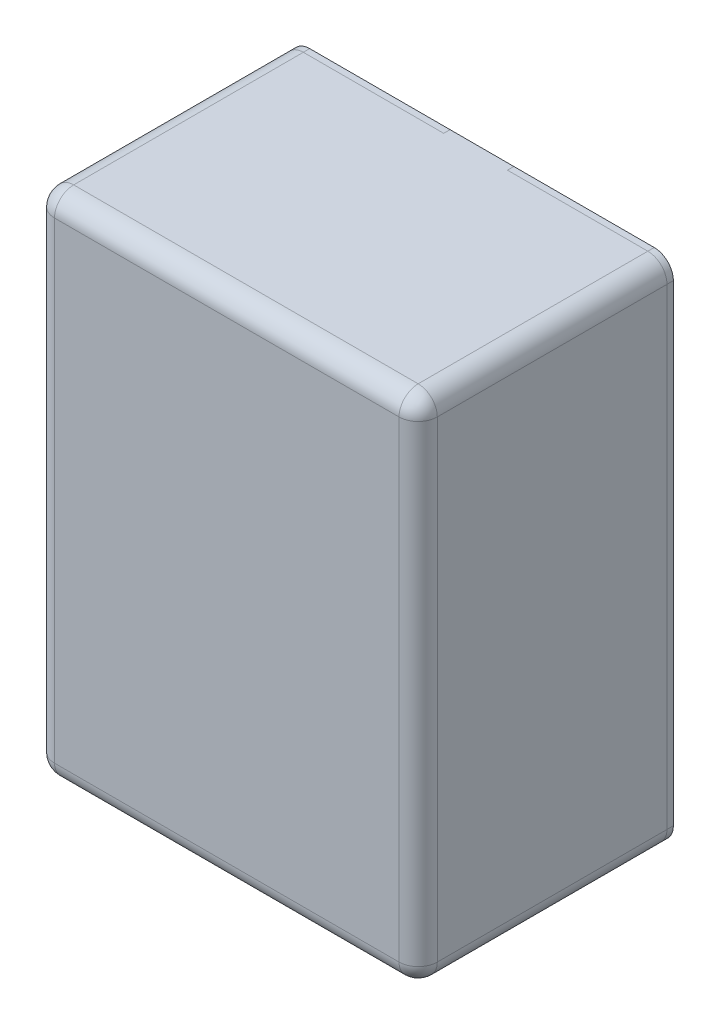
ISO-10303-21;
HEADER;
FILE_DESCRIPTION(('STEP AP214'),'2;1');
FILE_NAME('part.step','',(''),(''),'','','');
FILE_SCHEMA(('AUTOMOTIVE_DESIGN { 1 0 10303 214 1 1 1 1 }'));
ENDSEC;
DATA;
#1=APPLICATION_CONTEXT('core data for automotive mechanical design processes');
#2=APPLICATION_PROTOCOL_DEFINITION('international standard','automotive_design',2000,#1);
#3=PRODUCT_CONTEXT('',#1,'mechanical');
#4=PRODUCT('Part','Part','',(#3));
#5=PRODUCT_RELATED_PRODUCT_CATEGORY('part','',(#4));
#6=PRODUCT_DEFINITION_FORMATION('','',#4);
#7=PRODUCT_DEFINITION_CONTEXT('part definition',#1,'design');
#8=PRODUCT_DEFINITION('design','',#6,#7);
#9=PRODUCT_DEFINITION_SHAPE('','',#8);
#10=(LENGTH_UNIT() NAMED_UNIT(*) SI_UNIT(.MILLI.,.METRE.));
#11=(NAMED_UNIT(*) PLANE_ANGLE_UNIT() SI_UNIT($,.RADIAN.));
#12=(NAMED_UNIT(*) SI_UNIT($,.STERADIAN.) SOLID_ANGLE_UNIT());
#13=UNCERTAINTY_MEASURE_WITH_UNIT(LENGTH_MEASURE(1.E-05),#10,'distance_accuracy_value','');
#14=(GEOMETRIC_REPRESENTATION_CONTEXT(3) GLOBAL_UNCERTAINTY_ASSIGNED_CONTEXT((#13)) GLOBAL_UNIT_ASSIGNED_CONTEXT((#10,
#11,#12)) REPRESENTATION_CONTEXT('',''));
#15=CARTESIAN_POINT('',(0.,0.,0.));
#16=DIRECTION('',(0.,0.,1.));
#17=DIRECTION('',(1.,0.,0.));
#18=AXIS2_PLACEMENT_3D('',#15,#16,#17);
#19=CARTESIAN_POINT('',(-1.35,1.85,1.85));
#20=DIRECTION('',(0.,-1.,0.));
#21=DIRECTION('',(0.707106781186548,0.,-0.707106781186547));
#22=AXIS2_PLACEMENT_3D('',#19,#20,#21);
#23=CYLINDRICAL_SURFACE('',#22,0.15);
#24=CARTESIAN_POINT('',(-1.35,1.85,1.85));
#25=DIRECTION('',(0.,-1.,0.));
#26=DIRECTION('',(-1.,0.,0.));
#27=AXIS2_PLACEMENT_3D('',#24,#25,#26);
#28=CIRCLE('',#27,0.15);
#29=CARTESIAN_POINT('',(-1.35,1.85,2.));
#30=VERTEX_POINT('',#29);
#31=CARTESIAN_POINT('',(-1.5,1.85,1.85));
#32=VERTEX_POINT('',#31);
#33=EDGE_CURVE('E11',#30,#32,#28,.T.);
#34=ORIENTED_EDGE('',*,*,#33,.T.);
#35=DIRECTION('',(0.,-1.,0.));
#36=VECTOR('',#35,1.);
#37=CARTESIAN_POINT('',(-1.5,1.85,1.85));
#38=LINE('',#37,#36);
#39=CARTESIAN_POINT('',(-1.5,-1.85,1.85));
#40=VERTEX_POINT('',#39);
#41=EDGE_CURVE('E25',#32,#40,#38,.T.);
#42=ORIENTED_EDGE('',*,*,#41,.T.);
#43=CARTESIAN_POINT('',(-1.35,-1.85,1.85));
#44=DIRECTION('',(0.,-1.,0.));
#45=DIRECTION('',(-1.,0.,0.));
#46=AXIS2_PLACEMENT_3D('',#43,#44,#45);
#47=CIRCLE('',#46,0.15);
#48=CARTESIAN_POINT('',(-1.35,-1.85,2.));
#49=VERTEX_POINT('',#48);
#50=EDGE_CURVE('E431',#49,#40,#47,.T.);
#51=ORIENTED_EDGE('',*,*,#50,.F.);
#52=DIRECTION('',(0.,-1.,0.));
#53=VECTOR('',#52,1.);
#54=CARTESIAN_POINT('',(-1.35,1.85,2.));
#55=LINE('',#54,#53);
#56=EDGE_CURVE('E426',#30,#49,#55,.T.);
#57=ORIENTED_EDGE('',*,*,#56,.F.);
#58=EDGE_LOOP('',(#34,#42,#51,#57));
#59=FACE_BOUND('',#58,.T.);
#60=ADVANCED_FACE('F17',(#59),#23,.T.);
#61=CARTESIAN_POINT('',(-1.5,-2.,2.));
#62=DIRECTION('',(0.,0.,1.));
#63=DIRECTION('',(1.,0.,0.));
#64=AXIS2_PLACEMENT_3D('',#61,#62,#63);
#65=PLANE('',#64);
#66=DIRECTION('',(1.,0.,0.));
#67=VECTOR('',#66,1.);
#68=CARTESIAN_POINT('',(-1.35,-1.85,2.));
#69=LINE('',#68,#67);
#70=CARTESIAN_POINT('',(1.35,-1.85,2.));
#71=VERTEX_POINT('',#70);
#72=EDGE_CURVE('E422',#49,#71,#69,.T.);
#73=ORIENTED_EDGE('',*,*,#72,.T.);
#74=DIRECTION('',(0.,1.,0.));
#75=VECTOR('',#74,1.);
#76=CARTESIAN_POINT('',(1.35,-1.85,2.));
#77=LINE('',#76,#75);
#78=CARTESIAN_POINT('',(1.35,1.85,2.));
#79=VERTEX_POINT('',#78);
#80=EDGE_CURVE('E418',#71,#79,#77,.T.);
#81=ORIENTED_EDGE('',*,*,#80,.T.);
#82=DIRECTION('',(-1.,0.,0.));
#83=VECTOR('',#82,1.);
#84=CARTESIAN_POINT('',(1.35,1.85,2.));
#85=LINE('',#84,#83);
#86=EDGE_CURVE('E413',#79,#30,#85,.T.);
#87=ORIENTED_EDGE('',*,*,#86,.T.);
#88=ORIENTED_EDGE('',*,*,#56,.T.);
#89=EDGE_LOOP('',(#73,#81,#87,#88));
#90=FACE_BOUND('',#89,.T.);
#91=ADVANCED_FACE('F448',(#90),#65,.T.);
#92=CARTESIAN_POINT('',(1.35,1.85,1.85));
#93=DIRECTION('',(-1.,0.,0.));
#94=DIRECTION('',(0.,-0.707106781186548,-0.707106781186547));
#95=AXIS2_PLACEMENT_3D('',#92,#93,#94);
#96=CYLINDRICAL_SURFACE('',#95,0.15);
#97=CARTESIAN_POINT('',(1.35,1.85,1.85));
#98=DIRECTION('',(-1.,0.,0.));
#99=DIRECTION('',(0.,1.,0.));
#100=AXIS2_PLACEMENT_3D('',#97,#98,#99);
#101=CIRCLE('',#100,0.15);
#102=CARTESIAN_POINT('',(1.35,2.,1.85));
#103=VERTEX_POINT('',#102);
#104=EDGE_CURVE('E409',#79,#103,#101,.T.);
#105=ORIENTED_EDGE('',*,*,#104,.T.);
#106=DIRECTION('',(-1.,0.,0.));
#107=VECTOR('',#106,1.);
#108=CARTESIAN_POINT('',(1.35,2.,1.85));
#109=LINE('',#108,#107);
#110=CARTESIAN_POINT('',(-1.35,2.,1.85));
#111=VERTEX_POINT('',#110);
#112=EDGE_CURVE('E405',#103,#111,#109,.T.);
#113=ORIENTED_EDGE('',*,*,#112,.T.);
#114=CARTESIAN_POINT('',(-1.35,1.85,1.85));
#115=DIRECTION('',(-1.,0.,0.));
#116=DIRECTION('',(0.,0.,1.));
#117=AXIS2_PLACEMENT_3D('',#114,#115,#116);
#118=CIRCLE('',#117,0.15);
#119=EDGE_CURVE('E400',#30,#111,#118,.T.);
#120=ORIENTED_EDGE('',*,*,#119,.F.);
#121=ORIENTED_EDGE('',*,*,#86,.F.);
#122=EDGE_LOOP('',(#105,#113,#120,#121));
#123=FACE_BOUND('',#122,.T.);
#124=ADVANCED_FACE('F452',(#123),#96,.T.);
#125=CARTESIAN_POINT('',(-1.35,1.85,1.85));
#126=DIRECTION('',(-0.609395496705895,-0.492194586626505,-0.621596024351942));
#127=DIRECTION('',(0.788649817876852,-0.457034699362743,-0.411279404226879));
#128=AXIS2_PLACEMENT_3D('',#125,#126,#127);
#129=SPHERICAL_SURFACE('',#128,0.15);
#130=CARTESIAN_POINT('',(-1.35,1.85,1.85));
#131=DIRECTION('',(0.,0.,1.));
#132=DIRECTION('',(0.,1.,0.));
#133=AXIS2_PLACEMENT_3D('',#130,#131,#132);
#134=CIRCLE('',#133,0.15);
#135=EDGE_CURVE('E396',#111,#32,#134,.T.);
#136=ORIENTED_EDGE('',*,*,#135,.T.);
#137=ORIENTED_EDGE('',*,*,#33,.F.);
#138=ORIENTED_EDGE('',*,*,#119,.T.);
#139=EDGE_LOOP('',(#136,#137,#138));
#140=FACE_BOUND('',#139,.T.);
#141=ADVANCED_FACE('F455',(#140),#129,.T.);
#142=CARTESIAN_POINT('',(-1.35,1.85,0.));
#143=DIRECTION('',(0.,0.,1.));
#144=DIRECTION('',(0.707106781186547,-0.707106781186548,0.));
#145=AXIS2_PLACEMENT_3D('',#142,#143,#144);
#146=CYLINDRICAL_SURFACE('',#145,0.15);
#147=ORIENTED_EDGE('',*,*,#135,.F.);
#148=DIRECTION('',(0.,0.,1.));
#149=VECTOR('',#148,1.);
#150=CARTESIAN_POINT('',(-1.35,2.,0.));
#151=LINE('',#150,#149);
#152=CARTESIAN_POINT('',(-1.35,2.,0.05));
#153=VERTEX_POINT('',#152);
#154=EDGE_CURVE('E391',#153,#111,#151,.T.);
#155=ORIENTED_EDGE('',*,*,#154,.F.);
#156=CARTESIAN_POINT('',(-1.35,1.85,0.05));
#157=DIRECTION('',(0.,0.,-1.));
#158=DIRECTION('',(0.,-1.,0.));
#159=AXIS2_PLACEMENT_3D('',#156,#157,#158);
#160=CIRCLE('',#159,0.15);
#161=CARTESIAN_POINT('',(-1.5,1.85,0.05));
#162=VERTEX_POINT('',#161);
#163=EDGE_CURVE('E386',#162,#153,#160,.T.);
#164=ORIENTED_EDGE('',*,*,#163,.F.);
#165=DIRECTION('',(0.,0.,1.));
#166=VECTOR('',#165,1.);
#167=CARTESIAN_POINT('',(-1.5,1.85,0.));
#168=LINE('',#167,#166);
#169=EDGE_CURVE('E381',#162,#32,#168,.T.);
#170=ORIENTED_EDGE('',*,*,#169,.T.);
#171=EDGE_LOOP('',(#147,#155,#164,#170));
#172=FACE_BOUND('',#171,.T.);
#173=ADVANCED_FACE('F459',(#172),#146,.T.);
#174=CARTESIAN_POINT('',(-1.5,-2.,0.));
#175=DIRECTION('',(1.,0.,0.));
#176=DIRECTION('',(0.,0.,1.));
#177=AXIS2_PLACEMENT_3D('',#174,#175,#176);
#178=PLANE('',#177);
#179=ORIENTED_EDGE('',*,*,#41,.F.);
#180=ORIENTED_EDGE('',*,*,#169,.F.);
#181=DIRECTION('',(0.,1.,0.));
#182=VECTOR('',#181,1.);
#183=CARTESIAN_POINT('',(-1.5,-2.,0.05));
#184=LINE('',#183,#182);
#185=CARTESIAN_POINT('',(-1.5,-1.85,0.05));
#186=VERTEX_POINT('',#185);
#187=EDGE_CURVE('E376',#186,#162,#184,.T.);
#188=ORIENTED_EDGE('',*,*,#187,.F.);
#189=DIRECTION('',(0.,0.,1.));
#190=VECTOR('',#189,1.);
#191=CARTESIAN_POINT('',(-1.5,-1.85,0.));
#192=LINE('',#191,#190);
#193=EDGE_CURVE('E372',#186,#40,#192,.T.);
#194=ORIENTED_EDGE('',*,*,#193,.T.);
#195=EDGE_LOOP('',(#179,#180,#188,#194));
#196=FACE_BOUND('',#195,.T.);
#197=ADVANCED_FACE('F461',(#196),#178,.F.);
#198=CARTESIAN_POINT('',(-1.35,-1.85,0.));
#199=DIRECTION('',(0.,0.,1.));
#200=DIRECTION('',(0.707106781186547,0.707106781186548,0.));
#201=AXIS2_PLACEMENT_3D('',#198,#199,#200);
#202=CYLINDRICAL_SURFACE('',#201,0.15);
#203=ORIENTED_EDGE('',*,*,#193,.F.);
#204=CARTESIAN_POINT('',(-1.35,-1.85,0.05));
#205=DIRECTION('',(0.,0.,1.));
#206=DIRECTION('',(0.,-1.,0.));
#207=AXIS2_PLACEMENT_3D('',#204,#205,#206);
#208=CIRCLE('',#207,0.15);
#209=CARTESIAN_POINT('',(-1.35,-2.,0.05));
#210=VERTEX_POINT('',#209);
#211=EDGE_CURVE('E368',#186,#210,#208,.T.);
#212=ORIENTED_EDGE('',*,*,#211,.T.);
#213=DIRECTION('',(0.,0.,1.));
#214=VECTOR('',#213,1.);
#215=CARTESIAN_POINT('',(-1.35,-2.,0.));
#216=LINE('',#215,#214);
#217=CARTESIAN_POINT('',(-1.35,-2.,1.85));
#218=VERTEX_POINT('',#217);
#219=EDGE_CURVE('E364',#210,#218,#216,.T.);
#220=ORIENTED_EDGE('',*,*,#219,.T.);
#221=CARTESIAN_POINT('',(-1.35,-1.85,1.85));
#222=DIRECTION('',(0.,0.,1.));
#223=DIRECTION('',(-1.,0.,0.));
#224=AXIS2_PLACEMENT_3D('',#221,#222,#223);
#225=CIRCLE('',#224,0.15);
#226=EDGE_CURVE('E359',#40,#218,#225,.T.);
#227=ORIENTED_EDGE('',*,*,#226,.F.);
#228=EDGE_LOOP('',(#203,#212,#220,#227));
#229=FACE_BOUND('',#228,.T.);
#230=ADVANCED_FACE('F464',(#229),#202,.T.);
#231=CARTESIAN_POINT('',(-1.35,-1.85,1.85));
#232=DIRECTION('',(0.492194586626505,-0.609395496705894,-0.621596024351942));
#233=DIRECTION('',(0.457034699362742,0.788649817876852,-0.411279404226879));
#234=AXIS2_PLACEMENT_3D('',#231,#232,#233);
#235=SPHERICAL_SURFACE('',#234,0.15);
#236=ORIENTED_EDGE('',*,*,#226,.T.);
#237=CARTESIAN_POINT('',(-1.35,-1.85,1.85));
#238=DIRECTION('',(1.,0.,0.));
#239=DIRECTION('',(0.,-1.,0.));
#240=AXIS2_PLACEMENT_3D('',#237,#238,#239);
#241=CIRCLE('',#240,0.15);
#242=EDGE_CURVE('E354',#49,#218,#241,.T.);
#243=ORIENTED_EDGE('',*,*,#242,.F.);
#244=ORIENTED_EDGE('',*,*,#50,.T.);
#245=EDGE_LOOP('',(#236,#243,#244));
#246=FACE_BOUND('',#245,.T.);
#247=ADVANCED_FACE('F442',(#246),#235,.T.);
#248=CARTESIAN_POINT('',(-1.35,-1.85,1.85));
#249=DIRECTION('',(1.,0.,0.));
#250=DIRECTION('',(0.,0.707106781186548,-0.707106781186547));
#251=AXIS2_PLACEMENT_3D('',#248,#249,#250);
#252=CYLINDRICAL_SURFACE('',#251,0.15);
#253=ORIENTED_EDGE('',*,*,#242,.T.);
#254=DIRECTION('',(1.,0.,0.));
#255=VECTOR('',#254,1.);
#256=CARTESIAN_POINT('',(-1.35,-2.,1.85));
#257=LINE('',#256,#255);
#258=CARTESIAN_POINT('',(1.35,-2.,1.85));
#259=VERTEX_POINT('',#258);
#260=EDGE_CURVE('E350',#218,#259,#257,.T.);
#261=ORIENTED_EDGE('',*,*,#260,.T.);
#262=CARTESIAN_POINT('',(1.35,-1.85,1.85));
#263=DIRECTION('',(1.,0.,0.));
#264=DIRECTION('',(0.,0.,1.));
#265=AXIS2_PLACEMENT_3D('',#262,#263,#264);
#266=CIRCLE('',#265,0.15);
#267=EDGE_CURVE('E345',#71,#259,#266,.T.);
#268=ORIENTED_EDGE('',*,*,#267,.F.);
#269=ORIENTED_EDGE('',*,*,#72,.F.);
#270=EDGE_LOOP('',(#253,#261,#268,#269));
#271=FACE_BOUND('',#270,.T.);
#272=ADVANCED_FACE('F474',(#271),#252,.T.);
#273=CARTESIAN_POINT('',(1.35,-1.85,1.85));
#274=DIRECTION('',(0.609395496705895,0.492194586626505,-0.621596024351942));
#275=DIRECTION('',(-0.788649817876852,0.457034699362743,-0.411279404226879));
#276=AXIS2_PLACEMENT_3D('',#273,#274,#275);
#277=SPHERICAL_SURFACE('',#276,0.15);
#278=CARTESIAN_POINT('',(1.35,-1.85,1.85));
#279=DIRECTION('',(0.,0.,1.));
#280=DIRECTION('',(0.,-1.,0.));
#281=AXIS2_PLACEMENT_3D('',#278,#279,#280);
#282=CIRCLE('',#281,0.15);
#283=CARTESIAN_POINT('',(1.5,-1.85,1.85));
#284=VERTEX_POINT('',#283);
#285=EDGE_CURVE('E341',#259,#284,#282,.T.);
#286=ORIENTED_EDGE('',*,*,#285,.T.);
#287=CARTESIAN_POINT('',(1.35,-1.85,1.85));
#288=DIRECTION('',(0.,1.,0.));
#289=DIRECTION('',(1.,0.,0.));
#290=AXIS2_PLACEMENT_3D('',#287,#288,#289);
#291=CIRCLE('',#290,0.15);
#292=EDGE_CURVE('E336',#71,#284,#291,.T.);
#293=ORIENTED_EDGE('',*,*,#292,.F.);
#294=ORIENTED_EDGE('',*,*,#267,.T.);
#295=EDGE_LOOP('',(#286,#293,#294));
#296=FACE_BOUND('',#295,.T.);
#297=ADVANCED_FACE('F477',(#296),#277,.T.);
#298=CARTESIAN_POINT('',(1.35,-1.85,1.85));
#299=DIRECTION('',(0.,1.,0.));
#300=DIRECTION('',(-0.707106781186548,0.,-0.707106781186547));
#301=AXIS2_PLACEMENT_3D('',#298,#299,#300);
#302=CYLINDRICAL_SURFACE('',#301,0.15);
#303=ORIENTED_EDGE('',*,*,#292,.T.);
#304=DIRECTION('',(0.,1.,0.));
#305=VECTOR('',#304,1.);
#306=CARTESIAN_POINT('',(1.5,-1.85,1.85));
#307=LINE('',#306,#305);
#308=CARTESIAN_POINT('',(1.5,1.85,1.85));
#309=VERTEX_POINT('',#308);
#310=EDGE_CURVE('E332',#284,#309,#307,.T.);
#311=ORIENTED_EDGE('',*,*,#310,.T.);
#312=CARTESIAN_POINT('',(1.35,1.85,1.85));
#313=DIRECTION('',(0.,1.,0.));
#314=DIRECTION('',(0.,0.,1.));
#315=AXIS2_PLACEMENT_3D('',#312,#313,#314);
#316=CIRCLE('',#315,0.15);
#317=EDGE_CURVE('E327',#79,#309,#316,.T.);
#318=ORIENTED_EDGE('',*,*,#317,.F.);
#319=ORIENTED_EDGE('',*,*,#80,.F.);
#320=EDGE_LOOP('',(#303,#311,#318,#319));
#321=FACE_BOUND('',#320,.T.);
#322=ADVANCED_FACE('F479',(#321),#302,.T.);
#323=CARTESIAN_POINT('',(1.35,1.85,1.85));
#324=DIRECTION('',(-0.492194586626505,0.609395496705895,-0.621596024351942));
#325=DIRECTION('',(-0.457034699362743,-0.788649817876852,-0.411279404226879));
#326=AXIS2_PLACEMENT_3D('',#323,#324,#325);
#327=SPHERICAL_SURFACE('',#326,0.15);
#328=CARTESIAN_POINT('',(1.35,1.85,1.85));
#329=DIRECTION('',(0.,0.,1.));
#330=DIRECTION('',(1.,0.,0.));
#331=AXIS2_PLACEMENT_3D('',#328,#329,#330);
#332=CIRCLE('',#331,0.15);
#333=EDGE_CURVE('E322',#309,#103,#332,.T.);
#334=ORIENTED_EDGE('',*,*,#333,.T.);
#335=ORIENTED_EDGE('',*,*,#104,.F.);
#336=ORIENTED_EDGE('',*,*,#317,.T.);
#337=EDGE_LOOP('',(#334,#335,#336));
#338=FACE_BOUND('',#337,.T.);
#339=ADVANCED_FACE('F483',(#338),#327,.T.);
#340=CARTESIAN_POINT('',(1.35,1.85,0.));
#341=DIRECTION('',(0.,0.,1.));
#342=DIRECTION('',(-0.707106781186547,-0.707106781186548,0.));
#343=AXIS2_PLACEMENT_3D('',#340,#341,#342);
#344=CYLINDRICAL_SURFACE('',#343,0.15);
#345=DIRECTION('',(0.,0.,1.));
#346=VECTOR('',#345,1.);
#347=CARTESIAN_POINT('',(1.5,1.85,0.));
#348=LINE('',#347,#346);
#349=CARTESIAN_POINT('',(1.5,1.85,0.05));
#350=VERTEX_POINT('',#349);
#351=EDGE_CURVE('E317',#350,#309,#348,.T.);
#352=ORIENTED_EDGE('',*,*,#351,.F.);
#353=CARTESIAN_POINT('',(1.35,1.85,0.05));
#354=DIRECTION('',(0.,0.,1.));
#355=DIRECTION('',(0.,-1.,0.));
#356=AXIS2_PLACEMENT_3D('',#353,#354,#355);
#357=CIRCLE('',#356,0.15);
#358=CARTESIAN_POINT('',(1.35,2.,0.05));
#359=VERTEX_POINT('',#358);
#360=EDGE_CURVE('E313',#350,#359,#357,.T.);
#361=ORIENTED_EDGE('',*,*,#360,.T.);
#362=DIRECTION('',(0.,0.,1.));
#363=VECTOR('',#362,1.);
#364=CARTESIAN_POINT('',(1.35,2.,0.));
#365=LINE('',#364,#363);
#366=EDGE_CURVE('E308',#359,#103,#365,.T.);
#367=ORIENTED_EDGE('',*,*,#366,.T.);
#368=ORIENTED_EDGE('',*,*,#333,.F.);
#369=EDGE_LOOP('',(#352,#361,#367,#368));
#370=FACE_BOUND('',#369,.T.);
#371=ADVANCED_FACE('F487',(#370),#344,.T.);
#372=CARTESIAN_POINT('',(-1.5,2.,0.));
#373=DIRECTION('',(0.,1.,0.));
#374=DIRECTION('',(0.,0.,1.));
#375=AXIS2_PLACEMENT_3D('',#372,#373,#374);
#376=PLANE('',#375);
#377=DIRECTION('',(1.,0.,0.));
#378=VECTOR('',#377,1.);
#379=CARTESIAN_POINT('',(-1.5,2.,0.05));
#380=LINE('',#379,#378);
#381=CARTESIAN_POINT('',(-0.25,2.,0.05));
#382=VERTEX_POINT('',#381);
#383=EDGE_CURVE('E303',#153,#382,#380,.T.);
#384=ORIENTED_EDGE('',*,*,#383,.F.);
#385=ORIENTED_EDGE('',*,*,#154,.T.);
#386=ORIENTED_EDGE('',*,*,#112,.F.);
#387=ORIENTED_EDGE('',*,*,#366,.F.);
#388=DIRECTION('',(1.,0.,0.));
#389=VECTOR('',#388,1.);
#390=CARTESIAN_POINT('',(0.25,2.,0.05));
#391=LINE('',#390,#389);
#392=CARTESIAN_POINT('',(0.25,2.,0.05));
#393=VERTEX_POINT('',#392);
#394=EDGE_CURVE('E298',#393,#359,#391,.T.);
#395=ORIENTED_EDGE('',*,*,#394,.F.);
#396=DIRECTION('',(0.,0.,1.));
#397=VECTOR('',#396,1.);
#398=CARTESIAN_POINT('',(0.25,2.,0.));
#399=LINE('',#398,#397);
#400=CARTESIAN_POINT('',(0.25,2.,0.));
#401=VERTEX_POINT('',#400);
#402=EDGE_CURVE('E293',#401,#393,#399,.T.);
#403=ORIENTED_EDGE('',*,*,#402,.F.);
#404=DIRECTION('',(1.,0.,0.));
#405=VECTOR('',#404,1.);
#406=CARTESIAN_POINT('',(-1.5,2.,0.));
#407=LINE('',#406,#405);
#408=CARTESIAN_POINT('',(-0.25,2.,0.));
#409=VERTEX_POINT('',#408);
#410=EDGE_CURVE('E288',#409,#401,#407,.T.);
#411=ORIENTED_EDGE('',*,*,#410,.F.);
#412=DIRECTION('',(0.,0.,1.));
#413=VECTOR('',#412,1.);
#414=CARTESIAN_POINT('',(-0.25,2.,0.));
#415=LINE('',#414,#413);
#416=EDGE_CURVE('E284',#409,#382,#415,.T.);
#417=ORIENTED_EDGE('',*,*,#416,.T.);
#418=EDGE_LOOP('',(#384,#385,#386,#387,#395,#403,#411,#417));
#419=FACE_BOUND('',#418,.T.);
#420=ADVANCED_FACE('F491',(#419),#376,.T.);
#421=CARTESIAN_POINT('',(-1.5,2.,0.));
#422=DIRECTION('',(0.,1.,0.));
#423=DIRECTION('',(0.,0.,1.));
#424=AXIS2_PLACEMENT_3D('',#421,#422,#423);
#425=PLANE('',#424);
#426=DIRECTION('',(1.,0.,0.));
#427=VECTOR('',#426,1.);
#428=CARTESIAN_POINT('',(-1.5,2.,0.));
#429=LINE('',#428,#427);
#430=CARTESIAN_POINT('',(-1.35,2.,0.));
#431=VERTEX_POINT('',#430);
#432=EDGE_CURVE('E279',#431,#409,#429,.T.);
#433=ORIENTED_EDGE('',*,*,#432,.F.);
#434=DIRECTION('',(0.,0.,1.));
#435=VECTOR('',#434,1.);
#436=CARTESIAN_POINT('',(-1.35,2.,0.));
#437=LINE('',#436,#435);
#438=EDGE_CURVE('E274',#431,#153,#437,.T.);
#439=ORIENTED_EDGE('',*,*,#438,.T.);
#440=ORIENTED_EDGE('',*,*,#383,.T.);
#441=ORIENTED_EDGE('',*,*,#416,.F.);
#442=EDGE_LOOP('',(#433,#439,#440,#441));
#443=FACE_BOUND('',#442,.T.);
#444=ADVANCED_FACE('F495',(#443),#425,.T.);
#445=CARTESIAN_POINT('',(-1.35,1.85,0.));
#446=DIRECTION('',(0.,0.,1.));
#447=DIRECTION('',(0.707106781186547,-0.707106781186548,0.));
#448=AXIS2_PLACEMENT_3D('',#445,#446,#447);
#449=CYLINDRICAL_SURFACE('',#448,0.15);
#450=DIRECTION('',(0.,0.,1.));
#451=VECTOR('',#450,1.);
#452=CARTESIAN_POINT('',(-1.5,1.85,0.));
#453=LINE('',#452,#451);
#454=CARTESIAN_POINT('',(-1.5,1.85,0.));
#455=VERTEX_POINT('',#454);
#456=EDGE_CURVE('E269',#455,#162,#453,.T.);
#457=ORIENTED_EDGE('',*,*,#456,.T.);
#458=ORIENTED_EDGE('',*,*,#163,.T.);
#459=ORIENTED_EDGE('',*,*,#438,.F.);
#460=CARTESIAN_POINT('',(-1.35,1.85,0.));
#461=DIRECTION('',(0.,0.,-1.));
#462=DIRECTION('',(0.,-1.,0.));
#463=AXIS2_PLACEMENT_3D('',#460,#461,#462);
#464=CIRCLE('',#463,0.15);
#465=EDGE_CURVE('E264',#455,#431,#464,.T.);
#466=ORIENTED_EDGE('',*,*,#465,.F.);
#467=EDGE_LOOP('',(#457,#458,#459,#466));
#468=FACE_BOUND('',#467,.T.);
#469=ADVANCED_FACE('F497',(#468),#449,.T.);
#470=CARTESIAN_POINT('',(-1.5,-2.,0.));
#471=DIRECTION('',(0.,0.,1.));
#472=DIRECTION('',(1.,0.,0.));
#473=AXIS2_PLACEMENT_3D('',#470,#471,#472);
#474=PLANE('',#473);
#475=ORIENTED_EDGE('',*,*,#465,.T.);
#476=ORIENTED_EDGE('',*,*,#432,.T.);
#477=DIRECTION('',(0.,1.,0.));
#478=VECTOR('',#477,1.);
#479=CARTESIAN_POINT('',(-0.25,-2.,0.));
#480=LINE('',#479,#478);
#481=CARTESIAN_POINT('',(-0.25,-2.,0.));
#482=VERTEX_POINT('',#481);
#483=EDGE_CURVE('E259',#482,#409,#480,.T.);
#484=ORIENTED_EDGE('',*,*,#483,.F.);
#485=DIRECTION('',(1.,0.,0.));
#486=VECTOR('',#485,1.);
#487=CARTESIAN_POINT('',(-1.5,-2.,0.));
#488=LINE('',#487,#486);
#489=CARTESIAN_POINT('',(-1.35,-2.,0.));
#490=VERTEX_POINT('',#489);
#491=EDGE_CURVE('E254',#490,#482,#488,.T.);
#492=ORIENTED_EDGE('',*,*,#491,.F.);
#493=CARTESIAN_POINT('',(-1.35,-1.85,0.));
#494=DIRECTION('',(0.,0.,1.));
#495=DIRECTION('',(0.,-1.,0.));
#496=AXIS2_PLACEMENT_3D('',#493,#494,#495);
#497=CIRCLE('',#496,0.15);
#498=CARTESIAN_POINT('',(-1.5,-1.85,0.));
#499=VERTEX_POINT('',#498);
#500=EDGE_CURVE('E249',#499,#490,#497,.T.);
#501=ORIENTED_EDGE('',*,*,#500,.F.);
#502=DIRECTION('',(0.,1.,0.));
#503=VECTOR('',#502,1.);
#504=CARTESIAN_POINT('',(-1.5,-2.,0.));
#505=LINE('',#504,#503);
#506=EDGE_CURVE('E244',#499,#455,#505,.T.);
#507=ORIENTED_EDGE('',*,*,#506,.T.);
#508=EDGE_LOOP('',(#475,#476,#484,#492,#501,#507));
#509=FACE_BOUND('',#508,.T.);
#510=ADVANCED_FACE('F514',(#509),#474,.F.);
#511=CARTESIAN_POINT('',(-1.5,-2.,0.));
#512=DIRECTION('',(1.,0.,0.));
#513=DIRECTION('',(0.,0.,1.));
#514=AXIS2_PLACEMENT_3D('',#511,#512,#513);
#515=PLANE('',#514);
#516=ORIENTED_EDGE('',*,*,#456,.F.);
#517=ORIENTED_EDGE('',*,*,#506,.F.);
#518=DIRECTION('',(0.,0.,1.));
#519=VECTOR('',#518,1.);
#520=CARTESIAN_POINT('',(-1.5,-1.85,0.));
#521=LINE('',#520,#519);
#522=EDGE_CURVE('E239',#499,#186,#521,.T.);
#523=ORIENTED_EDGE('',*,*,#522,.T.);
#524=ORIENTED_EDGE('',*,*,#187,.T.);
#525=EDGE_LOOP('',(#516,#517,#523,#524));
#526=FACE_BOUND('',#525,.T.);
#527=ADVANCED_FACE('F501',(#526),#515,.F.);
#528=CARTESIAN_POINT('',(-1.35,-1.85,0.));
#529=DIRECTION('',(0.,0.,1.));
#530=DIRECTION('',(0.707106781186547,0.707106781186548,0.));
#531=AXIS2_PLACEMENT_3D('',#528,#529,#530);
#532=CYLINDRICAL_SURFACE('',#531,0.15);
#533=ORIENTED_EDGE('',*,*,#500,.T.);
#534=DIRECTION('',(0.,0.,1.));
#535=VECTOR('',#534,1.);
#536=CARTESIAN_POINT('',(-1.35,-2.,0.));
#537=LINE('',#536,#535);
#538=EDGE_CURVE('E234',#490,#210,#537,.T.);
#539=ORIENTED_EDGE('',*,*,#538,.T.);
#540=ORIENTED_EDGE('',*,*,#211,.F.);
#541=ORIENTED_EDGE('',*,*,#522,.F.);
#542=EDGE_LOOP('',(#533,#539,#540,#541));
#543=FACE_BOUND('',#542,.T.);
#544=ADVANCED_FACE('F504',(#543),#532,.T.);
#545=CARTESIAN_POINT('',(-1.5,-2.,0.));
#546=DIRECTION('',(0.,1.,0.));
#547=DIRECTION('',(0.,0.,1.));
#548=AXIS2_PLACEMENT_3D('',#545,#546,#547);
#549=PLANE('',#548);
#550=DIRECTION('',(0.,0.,1.));
#551=VECTOR('',#550,1.);
#552=CARTESIAN_POINT('',(-0.25,-2.,0.));
#553=LINE('',#552,#551);
#554=CARTESIAN_POINT('',(-0.25,-2.,0.05));
#555=VERTEX_POINT('',#554);
#556=EDGE_CURVE('E230',#482,#555,#553,.T.);
#557=ORIENTED_EDGE('',*,*,#556,.T.);
#558=DIRECTION('',(1.,0.,0.));
#559=VECTOR('',#558,1.);
#560=CARTESIAN_POINT('',(-1.5,-2.,0.05));
#561=LINE('',#560,#559);
#562=EDGE_CURVE('E225',#210,#555,#561,.T.);
#563=ORIENTED_EDGE('',*,*,#562,.F.);
#564=ORIENTED_EDGE('',*,*,#538,.F.);
#565=ORIENTED_EDGE('',*,*,#491,.T.);
#566=EDGE_LOOP('',(#557,#563,#564,#565));
#567=FACE_BOUND('',#566,.T.);
#568=ADVANCED_FACE('F508',(#567),#549,.F.);
#569=CARTESIAN_POINT('',(-1.5,-2.,0.));
#570=DIRECTION('',(0.,1.,0.));
#571=DIRECTION('',(0.,0.,1.));
#572=AXIS2_PLACEMENT_3D('',#569,#570,#571);
#573=PLANE('',#572);
#574=ORIENTED_EDGE('',*,*,#556,.F.);
#575=DIRECTION('',(1.,0.,0.));
#576=VECTOR('',#575,1.);
#577=CARTESIAN_POINT('',(-1.5,-2.,0.));
#578=LINE('',#577,#576);
#579=CARTESIAN_POINT('',(0.25,-2.,0.));
#580=VERTEX_POINT('',#579);
#581=EDGE_CURVE('E221',#482,#580,#578,.T.);
#582=ORIENTED_EDGE('',*,*,#581,.T.);
#583=DIRECTION('',(0.,0.,1.));
#584=VECTOR('',#583,1.);
#585=CARTESIAN_POINT('',(0.25,-2.,0.));
#586=LINE('',#585,#584);
#587=CARTESIAN_POINT('',(0.25,-2.,0.05));
#588=VERTEX_POINT('',#587);
#589=EDGE_CURVE('E163',#580,#588,#586,.T.);
#590=ORIENTED_EDGE('',*,*,#589,.T.);
#591=DIRECTION('',(1.,0.,0.));
#592=VECTOR('',#591,1.);
#593=CARTESIAN_POINT('',(0.25,-2.,0.05));
#594=LINE('',#593,#592);
#595=CARTESIAN_POINT('',(1.35,-2.,0.05));
#596=VERTEX_POINT('',#595);
#597=EDGE_CURVE('E214',#588,#596,#594,.T.);
#598=ORIENTED_EDGE('',*,*,#597,.T.);
#599=DIRECTION('',(0.,0.,1.));
#600=VECTOR('',#599,1.);
#601=CARTESIAN_POINT('',(1.35,-2.,0.));
#602=LINE('',#601,#600);
#603=EDGE_CURVE('E209',#596,#259,#602,.T.);
#604=ORIENTED_EDGE('',*,*,#603,.T.);
#605=ORIENTED_EDGE('',*,*,#260,.F.);
#606=ORIENTED_EDGE('',*,*,#219,.F.);
#607=ORIENTED_EDGE('',*,*,#562,.T.);
#608=EDGE_LOOP('',(#574,#582,#590,#598,#604,#605,#606,#607));
#609=FACE_BOUND('',#608,.T.);
#610=ADVANCED_FACE('F470',(#609),#573,.F.);
#611=CARTESIAN_POINT('',(1.35,-1.85,0.));
#612=DIRECTION('',(0.,0.,1.));
#613=DIRECTION('',(-0.707106781186547,0.707106781186548,0.));
#614=AXIS2_PLACEMENT_3D('',#611,#612,#613);
#615=CYLINDRICAL_SURFACE('',#614,0.15);
#616=ORIENTED_EDGE('',*,*,#285,.F.);
#617=ORIENTED_EDGE('',*,*,#603,.F.);
#618=CARTESIAN_POINT('',(1.35,-1.85,0.05));
#619=DIRECTION('',(0.,0.,-1.));
#620=DIRECTION('',(0.,-1.,0.));
#621=AXIS2_PLACEMENT_3D('',#618,#619,#620);
#622=CIRCLE('',#621,0.15);
#623=CARTESIAN_POINT('',(1.5,-1.85,0.05));
#624=VERTEX_POINT('',#623);
#625=EDGE_CURVE('E156',#624,#596,#622,.T.);
#626=ORIENTED_EDGE('',*,*,#625,.F.);
#627=DIRECTION('',(0.,0.,1.));
#628=VECTOR('',#627,1.);
#629=CARTESIAN_POINT('',(1.5,-1.85,0.));
#630=LINE('',#629,#628);
#631=EDGE_CURVE('E201',#624,#284,#630,.T.);
#632=ORIENTED_EDGE('',*,*,#631,.T.);
#633=EDGE_LOOP('',(#616,#617,#626,#632));
#634=FACE_BOUND('',#633,.T.);
#635=ADVANCED_FACE('F698',(#634),#615,.T.);
#636=CARTESIAN_POINT('',(1.5,-2.,0.));
#637=DIRECTION('',(1.,0.,0.));
#638=DIRECTION('',(0.,0.,1.));
#639=AXIS2_PLACEMENT_3D('',#636,#637,#638);
#640=PLANE('',#639);
#641=ORIENTED_EDGE('',*,*,#631,.F.);
#642=DIRECTION('',(0.,1.,0.));
#643=VECTOR('',#642,1.);
#644=CARTESIAN_POINT('',(1.5,-2.,0.05));
#645=LINE('',#644,#643);
#646=EDGE_CURVE('E196',#624,#350,#645,.T.);
#647=ORIENTED_EDGE('',*,*,#646,.T.);
#648=ORIENTED_EDGE('',*,*,#351,.T.);
#649=ORIENTED_EDGE('',*,*,#310,.F.);
#650=EDGE_LOOP('',(#641,#647,#648,#649));
#651=FACE_BOUND('',#650,.T.);
#652=ADVANCED_FACE('F606',(#651),#640,.T.);
#653=CARTESIAN_POINT('',(1.5,-2.,0.));
#654=DIRECTION('',(1.,0.,0.));
#655=DIRECTION('',(0.,0.,1.));
#656=AXIS2_PLACEMENT_3D('',#653,#654,#655);
#657=PLANE('',#656);
#658=ORIENTED_EDGE('',*,*,#646,.F.);
#659=DIRECTION('',(0.,0.,1.));
#660=VECTOR('',#659,1.);
#661=CARTESIAN_POINT('',(1.5,-1.85,0.));
#662=LINE('',#661,#660);
#663=CARTESIAN_POINT('',(1.5,-1.85,0.));
#664=VERTEX_POINT('',#663);
#665=EDGE_CURVE('E192',#664,#624,#662,.T.);
#666=ORIENTED_EDGE('',*,*,#665,.F.);
#667=DIRECTION('',(0.,1.,0.));
#668=VECTOR('',#667,1.);
#669=CARTESIAN_POINT('',(1.5,-2.,0.));
#670=LINE('',#669,#668);
#671=CARTESIAN_POINT('',(1.5,1.85,0.));
#672=VERTEX_POINT('',#671);
#673=EDGE_CURVE('E147',#664,#672,#670,.T.);
#674=ORIENTED_EDGE('',*,*,#673,.T.);
#675=DIRECTION('',(0.,0.,1.));
#676=VECTOR('',#675,1.);
#677=CARTESIAN_POINT('',(1.5,1.85,0.));
#678=LINE('',#677,#676);
#679=EDGE_CURVE('E184',#672,#350,#678,.T.);
#680=ORIENTED_EDGE('',*,*,#679,.T.);
#681=EDGE_LOOP('',(#658,#666,#674,#680));
#682=FACE_BOUND('',#681,.T.);
#683=ADVANCED_FACE('F601',(#682),#657,.T.);
#684=CARTESIAN_POINT('',(1.35,1.85,0.));
#685=DIRECTION('',(0.,0.,1.));
#686=DIRECTION('',(-0.707106781186547,-0.707106781186548,0.));
#687=AXIS2_PLACEMENT_3D('',#684,#685,#686);
#688=CYLINDRICAL_SURFACE('',#687,0.15);
#689=CARTESIAN_POINT('',(1.35,1.85,0.));
#690=DIRECTION('',(0.,0.,1.));
#691=DIRECTION('',(0.,-1.,0.));
#692=AXIS2_PLACEMENT_3D('',#689,#690,#691);
#693=CIRCLE('',#692,0.15);
#694=CARTESIAN_POINT('',(1.35,2.,0.));
#695=VERTEX_POINT('',#694);
#696=EDGE_CURVE('E180',#672,#695,#693,.T.);
#697=ORIENTED_EDGE('',*,*,#696,.T.);
#698=DIRECTION('',(0.,0.,1.));
#699=VECTOR('',#698,1.);
#700=CARTESIAN_POINT('',(1.35,2.,0.));
#701=LINE('',#700,#699);
#702=EDGE_CURVE('E175',#695,#359,#701,.T.);
#703=ORIENTED_EDGE('',*,*,#702,.T.);
#704=ORIENTED_EDGE('',*,*,#360,.F.);
#705=ORIENTED_EDGE('',*,*,#679,.F.);
#706=EDGE_LOOP('',(#697,#703,#704,#705));
#707=FACE_BOUND('',#706,.T.);
#708=ADVANCED_FACE('F605',(#707),#688,.T.);
#709=CARTESIAN_POINT('',(0.25,2.,0.));
#710=DIRECTION('',(0.,1.,0.));
#711=DIRECTION('',(0.,0.,1.));
#712=AXIS2_PLACEMENT_3D('',#709,#710,#711);
#713=PLANE('',#712);
#714=DIRECTION('',(1.,0.,0.));
#715=VECTOR('',#714,1.);
#716=CARTESIAN_POINT('',(0.25,2.,0.));
#717=LINE('',#716,#715);
#718=EDGE_CURVE('E150',#401,#695,#717,.T.);
#719=ORIENTED_EDGE('',*,*,#718,.F.);
#720=ORIENTED_EDGE('',*,*,#402,.T.);
#721=ORIENTED_EDGE('',*,*,#394,.T.);
#722=ORIENTED_EDGE('',*,*,#702,.F.);
#723=EDGE_LOOP('',(#719,#720,#721,#722));
#724=FACE_BOUND('',#723,.T.);
#725=ADVANCED_FACE('F617',(#724),#713,.T.);
#726=CARTESIAN_POINT('',(0.25,-2.,0.));
#727=DIRECTION('',(0.,0.,1.));
#728=DIRECTION('',(1.,0.,0.));
#729=AXIS2_PLACEMENT_3D('',#726,#727,#728);
#730=PLANE('',#729);
#731=ORIENTED_EDGE('',*,*,#696,.F.);
#732=ORIENTED_EDGE('',*,*,#673,.F.);
#733=CARTESIAN_POINT('',(1.35,-1.85,0.));
#734=DIRECTION('',(0.,0.,-1.));
#735=DIRECTION('',(0.,-1.,0.));
#736=AXIS2_PLACEMENT_3D('',#733,#734,#735);
#737=CIRCLE('',#736,0.15);
#738=CARTESIAN_POINT('',(1.35,-2.,0.));
#739=VERTEX_POINT('',#738);
#740=EDGE_CURVE('E139',#664,#739,#737,.T.);
#741=ORIENTED_EDGE('',*,*,#740,.T.);
#742=DIRECTION('',(1.,0.,0.));
#743=VECTOR('',#742,1.);
#744=CARTESIAN_POINT('',(0.25,-2.,0.));
#745=LINE('',#744,#743);
#746=EDGE_CURVE('E145',#580,#739,#745,.T.);
#747=ORIENTED_EDGE('',*,*,#746,.F.);
#748=DIRECTION('',(0.,1.,0.));
#749=VECTOR('',#748,1.);
#750=CARTESIAN_POINT('',(0.25,-2.,0.));
#751=LINE('',#750,#749);
#752=EDGE_CURVE('E160',#580,#401,#751,.T.);
#753=ORIENTED_EDGE('',*,*,#752,.T.);
#754=ORIENTED_EDGE('',*,*,#718,.T.);
#755=EDGE_LOOP('',(#731,#732,#741,#747,#753,#754));
#756=FACE_BOUND('',#755,.T.);
#757=ADVANCED_FACE('F142',(#756),#730,.F.);
#758=CARTESIAN_POINT('',(-1.5,-2.,0.));
#759=DIRECTION('',(0.,0.,1.));
#760=DIRECTION('',(1.,0.,0.));
#761=AXIS2_PLACEMENT_3D('',#758,#759,#760);
#762=PLANE('',#761);
#763=ORIENTED_EDGE('',*,*,#410,.T.);
#764=ORIENTED_EDGE('',*,*,#752,.F.);
#765=ORIENTED_EDGE('',*,*,#581,.F.);
#766=ORIENTED_EDGE('',*,*,#483,.T.);
#767=EDGE_LOOP('',(#763,#764,#765,#766));
#768=FACE_BOUND('',#767,.T.);
#769=ADVANCED_FACE('F512',(#768),#762,.F.);
#770=CARTESIAN_POINT('',(0.25,-2.,0.));
#771=DIRECTION('',(0.,1.,0.));
#772=DIRECTION('',(0.,0.,1.));
#773=AXIS2_PLACEMENT_3D('',#770,#771,#772);
#774=PLANE('',#773);
#775=DIRECTION('',(0.,0.,1.));
#776=VECTOR('',#775,1.);
#777=CARTESIAN_POINT('',(1.35,-2.,0.));
#778=LINE('',#777,#776);
#779=EDGE_CURVE('E154',#739,#596,#778,.T.);
#780=ORIENTED_EDGE('',*,*,#779,.T.);
#781=ORIENTED_EDGE('',*,*,#597,.F.);
#782=ORIENTED_EDGE('',*,*,#589,.F.);
#783=ORIENTED_EDGE('',*,*,#746,.T.);
#784=EDGE_LOOP('',(#780,#781,#782,#783));
#785=FACE_BOUND('',#784,.T.);
#786=ADVANCED_FACE('F162',(#785),#774,.F.);
#787=CARTESIAN_POINT('',(1.35,-1.85,0.));
#788=DIRECTION('',(0.,0.,1.));
#789=DIRECTION('',(-0.707106781186547,0.707106781186548,0.));
#790=AXIS2_PLACEMENT_3D('',#787,#788,#789);
#791=CYLINDRICAL_SURFACE('',#790,0.15);
#792=ORIENTED_EDGE('',*,*,#665,.T.);
#793=ORIENTED_EDGE('',*,*,#625,.T.);
#794=ORIENTED_EDGE('',*,*,#779,.F.);
#795=ORIENTED_EDGE('',*,*,#740,.F.);
#796=EDGE_LOOP('',(#792,#793,#794,#795));
#797=FACE_BOUND('',#796,.T.);
#798=ADVANCED_FACE('F155',(#797),#791,.T.);
#799=CLOSED_SHELL('',(#60,#91,#124,#141,#173,#197,#230,#247,#272,#297,#322,#339,#371,#420,#444,
#469,#510,#527,#544,#568,#610,#635,#652,#683,#708,#725,#757,#769,#786,#798));
#800=MANIFOLD_SOLID_BREP('B1',#799);
#801=ADVANCED_BREP_SHAPE_REPRESENTATION('',(#18,#800),#14);
#802=SHAPE_DEFINITION_REPRESENTATION(#9,#801);
ENDSEC;
END-ISO-10303-21;
